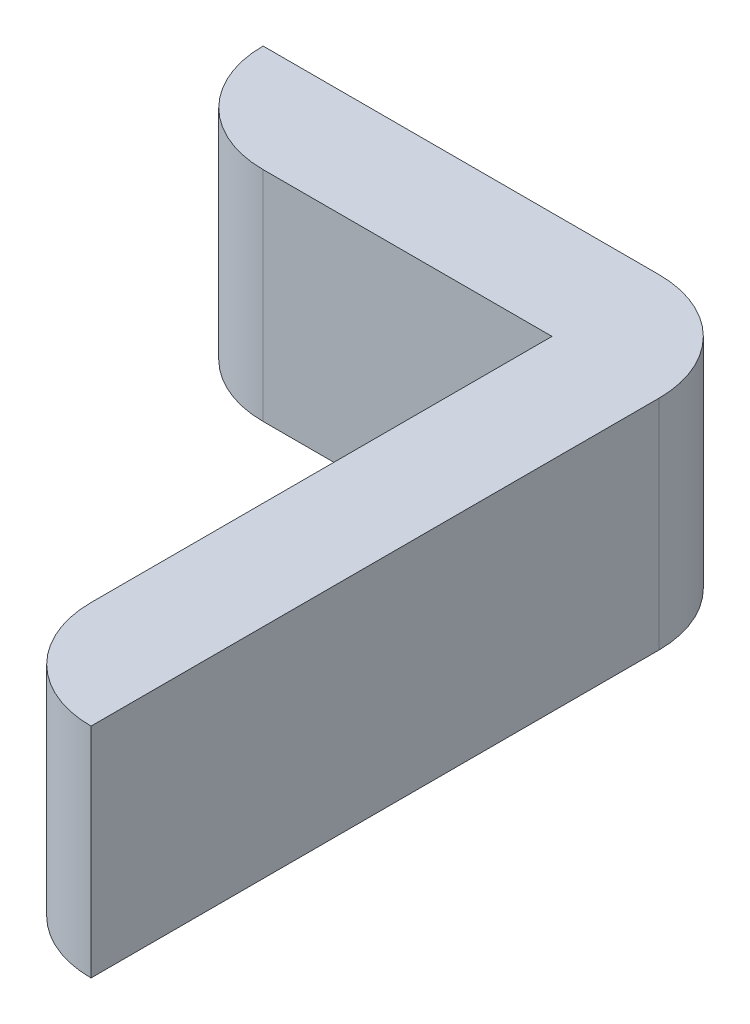
ISO-10303-21;
HEADER;
FILE_DESCRIPTION(('STEP AP214'),'2;1');
FILE_NAME('part.step','',(''),(''),'','','');
FILE_SCHEMA(('AUTOMOTIVE_DESIGN { 1 0 10303 214 1 1 1 1 }'));
ENDSEC;
DATA;
#1=APPLICATION_CONTEXT('core data for automotive mechanical design processes');
#2=APPLICATION_PROTOCOL_DEFINITION('international standard','automotive_design',2000,#1);
#3=PRODUCT_CONTEXT('',#1,'mechanical');
#4=PRODUCT('Part','Part','',(#3));
#5=PRODUCT_RELATED_PRODUCT_CATEGORY('part','',(#4));
#6=PRODUCT_DEFINITION_FORMATION('','',#4);
#7=PRODUCT_DEFINITION_CONTEXT('part definition',#1,'design');
#8=PRODUCT_DEFINITION('design','',#6,#7);
#9=PRODUCT_DEFINITION_SHAPE('','',#8);
#10=(LENGTH_UNIT() NAMED_UNIT(*) SI_UNIT(.MILLI.,.METRE.));
#11=(NAMED_UNIT(*) PLANE_ANGLE_UNIT() SI_UNIT($,.RADIAN.));
#12=(NAMED_UNIT(*) SI_UNIT($,.STERADIAN.) SOLID_ANGLE_UNIT());
#13=UNCERTAINTY_MEASURE_WITH_UNIT(LENGTH_MEASURE(1.E-05),#10,'distance_accuracy_value','');
#14=(GEOMETRIC_REPRESENTATION_CONTEXT(3) GLOBAL_UNCERTAINTY_ASSIGNED_CONTEXT((#13)) GLOBAL_UNIT_ASSIGNED_CONTEXT((#10,
#11,#12)) REPRESENTATION_CONTEXT('',''));
#15=CARTESIAN_POINT('',(0.,0.,0.));
#16=DIRECTION('',(0.,0.,1.));
#17=DIRECTION('',(1.,0.,0.));
#18=AXIS2_PLACEMENT_3D('',#15,#16,#17);
#19=CARTESIAN_POINT('',(-0.125,1.5248,0.));
#20=DIRECTION('',(0.,-1.,0.));
#21=DIRECTION('',(0.,0.,-1.));
#22=AXIS2_PLACEMENT_3D('',#19,#20,#21);
#23=PLANE('',#22);
#24=DIRECTION('',(-1.,0.,0.));
#25=VECTOR('',#24,1.);
#26=CARTESIAN_POINT('',(0.125,1.5248,0.25));
#27=LINE('',#26,#25);
#28=CARTESIAN_POINT('',(0.125,1.5248,0.25));
#29=VERTEX_POINT('',#28);
#30=CARTESIAN_POINT('',(0.8,1.5248,0.25));
#31=VERTEX_POINT('',#30);
#32=EDGE_CURVE('E102',#29,#31,#27,.F.);
#33=ORIENTED_EDGE('',*,*,#32,.T.);
#34=DIRECTION('',(0.,0.,-1.));
#35=VECTOR('',#34,1.);
#36=CARTESIAN_POINT('',(0.8,1.5248,0.25));
#37=LINE('',#36,#35);
#38=CARTESIAN_POINT('',(0.8,1.5248,1.327));
#39=VERTEX_POINT('',#38);
#40=EDGE_CURVE('E108',#31,#39,#37,.F.);
#41=ORIENTED_EDGE('',*,*,#40,.T.);
#42=CARTESIAN_POINT('',(1.05,1.5248,1.327));
#43=DIRECTION('',(0.,-1.,0.));
#44=DIRECTION('',(0.,0.,-1.));
#45=AXIS2_PLACEMENT_3D('',#42,#43,#44);
#46=CIRCLE('',#45,0.25);
#47=CARTESIAN_POINT('',(1.05,1.5248,1.577));
#48=VERTEX_POINT('',#47);
#49=EDGE_CURVE('E80',#48,#39,#46,.T.);
#50=ORIENTED_EDGE('',*,*,#49,.F.);
#51=DIRECTION('',(0.,0.,1.));
#52=VECTOR('',#51,1.);
#53=CARTESIAN_POINT('',(1.05,1.5248,1.577));
#54=LINE('',#53,#52);
#55=CARTESIAN_POINT('',(1.05,1.5248,0.25));
#56=VERTEX_POINT('',#55);
#57=EDGE_CURVE('E75',#48,#56,#54,.F.);
#58=ORIENTED_EDGE('',*,*,#57,.T.);
#59=CARTESIAN_POINT('',(0.8,1.5248,0.25));
#60=DIRECTION('',(0.,-1.,0.));
#61=DIRECTION('',(0.,0.,-1.));
#62=AXIS2_PLACEMENT_3D('',#59,#60,#61);
#63=CIRCLE('',#62,0.25);
#64=CARTESIAN_POINT('',(0.8,1.5248,0.));
#65=VERTEX_POINT('',#64);
#66=EDGE_CURVE('E19',#65,#56,#63,.T.);
#67=ORIENTED_EDGE('',*,*,#66,.F.);
#68=DIRECTION('',(1.,0.,0.));
#69=VECTOR('',#68,1.);
#70=CARTESIAN_POINT('',(0.8,1.5248,0.));
#71=LINE('',#70,#69);
#72=CARTESIAN_POINT('',(-0.125,1.5248,0.));
#73=VERTEX_POINT('',#72);
#74=EDGE_CURVE('E70',#65,#73,#71,.F.);
#75=ORIENTED_EDGE('',*,*,#74,.T.);
#76=CARTESIAN_POINT('',(0.125,1.5248,0.));
#77=DIRECTION('',(0.,-1.,0.));
#78=DIRECTION('',(0.,0.,-1.));
#79=AXIS2_PLACEMENT_3D('',#76,#77,#78);
#80=CIRCLE('',#79,0.25);
#81=EDGE_CURVE('E121',#29,#73,#80,.T.);
#82=ORIENTED_EDGE('',*,*,#81,.F.);
#83=EDGE_LOOP('',(#33,#41,#50,#58,#67,#75,#82));
#84=FACE_BOUND('',#83,.T.);
#85=ADVANCED_FACE('F16',(#84),#23,.F.);
#86=CARTESIAN_POINT('',(0.8,1.0152,0.));
#87=DIRECTION('',(0.,0.,1.));
#88=DIRECTION('',(1.,0.,0.));
#89=AXIS2_PLACEMENT_3D('',#86,#87,#88);
#90=PLANE('',#89);
#91=DIRECTION('',(0.,-1.,0.));
#92=VECTOR('',#91,1.);
#93=CARTESIAN_POINT('',(-0.125,1.0152,0.));
#94=LINE('',#93,#92);
#95=CARTESIAN_POINT('',(-0.125,1.0152,0.));
#96=VERTEX_POINT('',#95);
#97=EDGE_CURVE('E123',#73,#96,#94,.T.);
#98=ORIENTED_EDGE('',*,*,#97,.F.);
#99=ORIENTED_EDGE('',*,*,#74,.F.);
#100=DIRECTION('',(0.,-1.,0.));
#101=VECTOR('',#100,1.);
#102=CARTESIAN_POINT('',(0.8,1.0152,0.));
#103=LINE('',#102,#101);
#104=CARTESIAN_POINT('',(0.8,1.0152,0.));
#105=VERTEX_POINT('',#104);
#106=EDGE_CURVE('E92',#105,#65,#103,.F.);
#107=ORIENTED_EDGE('',*,*,#106,.F.);
#108=DIRECTION('',(1.,0.,0.));
#109=VECTOR('',#108,1.);
#110=CARTESIAN_POINT('',(-0.125,1.0152,0.));
#111=LINE('',#110,#109);
#112=EDGE_CURVE('E120',#96,#105,#111,.T.);
#113=ORIENTED_EDGE('',*,*,#112,.F.);
#114=EDGE_LOOP('',(#98,#99,#107,#113));
#115=FACE_BOUND('',#114,.T.);
#116=ADVANCED_FACE('F158',(#115),#90,.F.);
#117=CARTESIAN_POINT('',(0.8,1.0152,0.25));
#118=DIRECTION('',(0.,-1.,0.));
#119=DIRECTION('',(0.,0.,-1.));
#120=AXIS2_PLACEMENT_3D('',#117,#118,#119);
#121=CYLINDRICAL_SURFACE('',#120,0.25);
#122=ORIENTED_EDGE('',*,*,#66,.T.);
#123=DIRECTION('',(0.,1.,0.));
#124=VECTOR('',#123,1.);
#125=CARTESIAN_POINT('',(1.05,1.0152,0.25));
#126=LINE('',#125,#124);
#127=CARTESIAN_POINT('',(1.05,1.0152,0.25));
#128=VERTEX_POINT('',#127);
#129=EDGE_CURVE('E86',#56,#128,#126,.F.);
#130=ORIENTED_EDGE('',*,*,#129,.T.);
#131=CARTESIAN_POINT('',(0.8,1.0152,0.25));
#132=DIRECTION('',(0.,-1.,0.));
#133=DIRECTION('',(0.,0.,-1.));
#134=AXIS2_PLACEMENT_3D('',#131,#132,#133);
#135=CIRCLE('',#134,0.25);
#136=EDGE_CURVE('E118',#105,#128,#135,.T.);
#137=ORIENTED_EDGE('',*,*,#136,.F.);
#138=ORIENTED_EDGE('',*,*,#106,.T.);
#139=EDGE_LOOP('',(#122,#130,#137,#138));
#140=FACE_BOUND('',#139,.T.);
#141=ADVANCED_FACE('F89',(#140),#121,.T.);
#142=CARTESIAN_POINT('',(1.05,1.0152,1.577));
#143=DIRECTION('',(-1.,0.,0.));
#144=DIRECTION('',(0.,0.,1.));
#145=AXIS2_PLACEMENT_3D('',#142,#143,#144);
#146=PLANE('',#145);
#147=DIRECTION('',(0.,-1.,0.));
#148=VECTOR('',#147,1.);
#149=CARTESIAN_POINT('',(1.05,1.0152,1.577));
#150=LINE('',#149,#148);
#151=CARTESIAN_POINT('',(1.05,1.0152,1.577));
#152=VERTEX_POINT('',#151);
#153=EDGE_CURVE('E85',#152,#48,#150,.F.);
#154=ORIENTED_EDGE('',*,*,#153,.F.);
#155=DIRECTION('',(0.,0.,-1.));
#156=VECTOR('',#155,1.);
#157=CARTESIAN_POINT('',(1.05,1.0152,0.));
#158=LINE('',#157,#156);
#159=EDGE_CURVE('E94',#128,#152,#158,.F.);
#160=ORIENTED_EDGE('',*,*,#159,.F.);
#161=ORIENTED_EDGE('',*,*,#129,.F.);
#162=ORIENTED_EDGE('',*,*,#57,.F.);
#163=EDGE_LOOP('',(#154,#160,#161,#162));
#164=FACE_BOUND('',#163,.T.);
#165=ADVANCED_FACE('F93',(#164),#146,.F.);
#166=CARTESIAN_POINT('',(1.05,1.0152,1.327));
#167=DIRECTION('',(0.,-1.,0.));
#168=DIRECTION('',(0.,0.,-1.));
#169=AXIS2_PLACEMENT_3D('',#166,#167,#168);
#170=CYLINDRICAL_SURFACE('',#169,0.25);
#171=ORIENTED_EDGE('',*,*,#49,.T.);
#172=DIRECTION('',(0.,1.,0.));
#173=VECTOR('',#172,1.);
#174=CARTESIAN_POINT('',(0.8,1.0152,1.327));
#175=LINE('',#174,#173);
#176=CARTESIAN_POINT('',(0.8,1.0152,1.327));
#177=VERTEX_POINT('',#176);
#178=EDGE_CURVE('E105',#39,#177,#175,.F.);
#179=ORIENTED_EDGE('',*,*,#178,.T.);
#180=CARTESIAN_POINT('',(1.05,1.0152,1.327));
#181=DIRECTION('',(0.,-1.,0.));
#182=DIRECTION('',(0.,0.,-1.));
#183=AXIS2_PLACEMENT_3D('',#180,#181,#182);
#184=CIRCLE('',#183,0.25);
#185=EDGE_CURVE('E114',#152,#177,#184,.T.);
#186=ORIENTED_EDGE('',*,*,#185,.F.);
#187=ORIENTED_EDGE('',*,*,#153,.T.);
#188=EDGE_LOOP('',(#171,#179,#186,#187));
#189=FACE_BOUND('',#188,.T.);
#190=ADVANCED_FACE('F127',(#189),#170,.T.);
#191=CARTESIAN_POINT('',(0.8,1.0152,0.25));
#192=DIRECTION('',(1.,0.,0.));
#193=DIRECTION('',(0.,0.,-1.));
#194=AXIS2_PLACEMENT_3D('',#191,#192,#193);
#195=PLANE('',#194);
#196=ORIENTED_EDGE('',*,*,#178,.F.);
#197=ORIENTED_EDGE('',*,*,#40,.F.);
#198=DIRECTION('',(0.,1.,0.));
#199=VECTOR('',#198,1.);
#200=CARTESIAN_POINT('',(0.8,1.0152,0.25));
#201=LINE('',#200,#199);
#202=CARTESIAN_POINT('',(0.8,1.0152,0.25));
#203=VERTEX_POINT('',#202);
#204=EDGE_CURVE('E104',#31,#203,#201,.F.);
#205=ORIENTED_EDGE('',*,*,#204,.T.);
#206=DIRECTION('',(0.,0.,-1.));
#207=VECTOR('',#206,1.);
#208=CARTESIAN_POINT('',(0.8,1.0152,0.));
#209=LINE('',#208,#207);
#210=EDGE_CURVE('E117',#177,#203,#209,.T.);
#211=ORIENTED_EDGE('',*,*,#210,.F.);
#212=EDGE_LOOP('',(#196,#197,#205,#211));
#213=FACE_BOUND('',#212,.T.);
#214=ADVANCED_FACE('F150',(#213),#195,.F.);
#215=CARTESIAN_POINT('',(0.125,1.0152,0.25));
#216=DIRECTION('',(0.,0.,-1.));
#217=DIRECTION('',(-1.,0.,0.));
#218=AXIS2_PLACEMENT_3D('',#215,#216,#217);
#219=PLANE('',#218);
#220=ORIENTED_EDGE('',*,*,#204,.F.);
#221=ORIENTED_EDGE('',*,*,#32,.F.);
#222=DIRECTION('',(0.,-1.,0.));
#223=VECTOR('',#222,1.);
#224=CARTESIAN_POINT('',(0.125,1.0152,0.25));
#225=LINE('',#224,#223);
#226=CARTESIAN_POINT('',(0.125,1.0152,0.25));
#227=VERTEX_POINT('',#226);
#228=EDGE_CURVE('E34',#227,#29,#225,.F.);
#229=ORIENTED_EDGE('',*,*,#228,.F.);
#230=DIRECTION('',(1.,0.,0.));
#231=VECTOR('',#230,1.);
#232=CARTESIAN_POINT('',(-0.125,1.0152,0.25));
#233=LINE('',#232,#231);
#234=EDGE_CURVE('E25',#203,#227,#233,.F.);
#235=ORIENTED_EDGE('',*,*,#234,.F.);
#236=EDGE_LOOP('',(#220,#221,#229,#235));
#237=FACE_BOUND('',#236,.T.);
#238=ADVANCED_FACE('F151',(#237),#219,.F.);
#239=CARTESIAN_POINT('',(0.125,1.0152,0.));
#240=DIRECTION('',(0.,-1.,0.));
#241=DIRECTION('',(0.,0.,-1.));
#242=AXIS2_PLACEMENT_3D('',#239,#240,#241);
#243=CYLINDRICAL_SURFACE('',#242,0.25);
#244=ORIENTED_EDGE('',*,*,#81,.T.);
#245=ORIENTED_EDGE('',*,*,#97,.T.);
#246=CARTESIAN_POINT('',(0.125,1.0152,0.));
#247=DIRECTION('',(0.,-1.,0.));
#248=DIRECTION('',(0.,0.,-1.));
#249=AXIS2_PLACEMENT_3D('',#246,#247,#248);
#250=CIRCLE('',#249,0.25);
#251=EDGE_CURVE('E11',#227,#96,#250,.T.);
#252=ORIENTED_EDGE('',*,*,#251,.F.);
#253=ORIENTED_EDGE('',*,*,#228,.T.);
#254=EDGE_LOOP('',(#244,#245,#252,#253));
#255=FACE_BOUND('',#254,.T.);
#256=ADVANCED_FACE('F156',(#255),#243,.T.);
#257=CARTESIAN_POINT('',(-0.125,1.0152,0.));
#258=DIRECTION('',(0.,-1.,0.));
#259=DIRECTION('',(0.,0.,-1.));
#260=AXIS2_PLACEMENT_3D('',#257,#258,#259);
#261=PLANE('',#260);
#262=ORIENTED_EDGE('',*,*,#234,.T.);
#263=ORIENTED_EDGE('',*,*,#251,.T.);
#264=ORIENTED_EDGE('',*,*,#112,.T.);
#265=ORIENTED_EDGE('',*,*,#136,.T.);
#266=ORIENTED_EDGE('',*,*,#159,.T.);
#267=ORIENTED_EDGE('',*,*,#185,.T.);
#268=ORIENTED_EDGE('',*,*,#210,.T.);
#269=EDGE_LOOP('',(#262,#263,#264,#265,#266,#267,#268));
#270=FACE_BOUND('',#269,.T.);
#271=ADVANCED_FACE('F132',(#270),#261,.T.);
#272=CLOSED_SHELL('',(#85,#116,#141,#165,#190,#214,#238,#256,#271));
#273=MANIFOLD_SOLID_BREP('B1',#272);
#274=ADVANCED_BREP_SHAPE_REPRESENTATION('',(#18,#273),#14);
#275=SHAPE_DEFINITION_REPRESENTATION(#9,#274);
ENDSEC;
END-ISO-10303-21;
